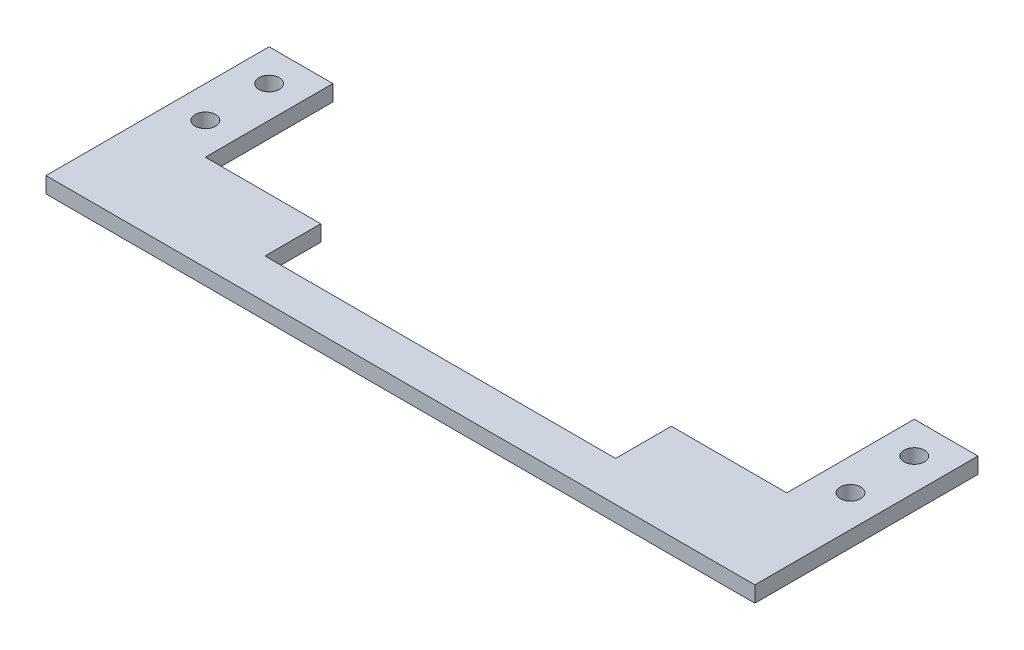
ISO-10303-21;
HEADER;
FILE_DESCRIPTION(('STEP AP214'),'2;1');
FILE_NAME('part.step','',(''),(''),'','','');
FILE_SCHEMA(('AUTOMOTIVE_DESIGN { 1 0 10303 214 1 1 1 1 }'));
ENDSEC;
DATA;
#1=APPLICATION_CONTEXT('core data for automotive mechanical design processes');
#2=APPLICATION_PROTOCOL_DEFINITION('international standard','automotive_design',2000,#1);
#3=PRODUCT_CONTEXT('',#1,'mechanical');
#4=PRODUCT('Part','Part','',(#3));
#5=PRODUCT_RELATED_PRODUCT_CATEGORY('part','',(#4));
#6=PRODUCT_DEFINITION_FORMATION('','',#4);
#7=PRODUCT_DEFINITION_CONTEXT('part definition',#1,'design');
#8=PRODUCT_DEFINITION('design','',#6,#7);
#9=PRODUCT_DEFINITION_SHAPE('','',#8);
#10=(LENGTH_UNIT() NAMED_UNIT(*) SI_UNIT(.MILLI.,.METRE.));
#11=(NAMED_UNIT(*) PLANE_ANGLE_UNIT() SI_UNIT($,.RADIAN.));
#12=(NAMED_UNIT(*) SI_UNIT($,.STERADIAN.) SOLID_ANGLE_UNIT());
#13=UNCERTAINTY_MEASURE_WITH_UNIT(LENGTH_MEASURE(1.E-05),#10,'distance_accuracy_value','');
#14=(GEOMETRIC_REPRESENTATION_CONTEXT(3) GLOBAL_UNCERTAINTY_ASSIGNED_CONTEXT((#13)) GLOBAL_UNIT_ASSIGNED_CONTEXT((#10,
#11,#12)) REPRESENTATION_CONTEXT('',''));
#15=CARTESIAN_POINT('',(0.,0.,0.));
#16=DIRECTION('',(0.,0.,1.));
#17=DIRECTION('',(1.,0.,0.));
#18=AXIS2_PLACEMENT_3D('',#15,#16,#17);
#19=CARTESIAN_POINT('',(0.,3.175,-19.0500000000001));
#20=DIRECTION('',(0.,0.,-1.));
#21=DIRECTION('',(-1.,0.,0.));
#22=AXIS2_PLACEMENT_3D('',#19,#20,#21);
#23=PLANE('',#22);
#24=DIRECTION('',(1.,0.,0.));
#25=VECTOR('',#24,1.);
#26=CARTESIAN_POINT('',(0.,0.,-19.0500000000001));
#27=LINE('',#26,#25);
#28=CARTESIAN_POINT('',(105.537,0.,-19.05));
#29=VERTEX_POINT('',#28);
#30=CARTESIAN_POINT('',(128.524,0.,-19.05));
#31=VERTEX_POINT('',#30);
#32=EDGE_CURVE('E181',#29,#31,#27,.T.);
#33=ORIENTED_EDGE('',*,*,#32,.F.);
#34=DIRECTION('',(0.,-1.,0.));
#35=VECTOR('',#34,1.);
#36=CARTESIAN_POINT('',(105.537,3.175,-19.05));
#37=LINE('',#36,#35);
#38=CARTESIAN_POINT('',(105.537,3.175,-19.05));
#39=VERTEX_POINT('',#38);
#40=EDGE_CURVE('E11',#39,#29,#37,.T.);
#41=ORIENTED_EDGE('',*,*,#40,.F.);
#42=DIRECTION('',(1.,0.,0.));
#43=VECTOR('',#42,1.);
#44=CARTESIAN_POINT('',(0.,3.175,-19.0500000000001));
#45=LINE('',#44,#43);
#46=CARTESIAN_POINT('',(128.524,3.175,-19.05));
#47=VERTEX_POINT('',#46);
#48=EDGE_CURVE('E433',#39,#47,#45,.T.);
#49=ORIENTED_EDGE('',*,*,#48,.T.);
#50=DIRECTION('',(0.,-1.,0.));
#51=VECTOR('',#50,1.);
#52=CARTESIAN_POINT('',(128.524,3.175,-19.05));
#53=LINE('',#52,#51);
#54=EDGE_CURVE('E50',#47,#31,#53,.T.);
#55=ORIENTED_EDGE('',*,*,#54,.T.);
#56=EDGE_LOOP('',(#33,#41,#49,#55));
#57=FACE_BOUND('',#56,.T.);
#58=ADVANCED_FACE('F33',(#57),#23,.T.);
#59=CARTESIAN_POINT('',(105.537,3.175,0.));
#60=DIRECTION('',(1.,0.,0.));
#61=DIRECTION('',(0.,0.,-1.));
#62=AXIS2_PLACEMENT_3D('',#59,#60,#61);
#63=PLANE('',#62);
#64=DIRECTION('',(0.,0.,1.));
#65=VECTOR('',#64,1.);
#66=CARTESIAN_POINT('',(105.537,0.,0.));
#67=LINE('',#66,#65);
#68=CARTESIAN_POINT('',(105.537,0.,-7.93750000000001));
#69=VERTEX_POINT('',#68);
#70=EDGE_CURVE('E178',#29,#69,#67,.T.);
#71=ORIENTED_EDGE('',*,*,#70,.T.);
#72=DIRECTION('',(0.,-1.,0.));
#73=VECTOR('',#72,1.);
#74=CARTESIAN_POINT('',(105.537,3.175,-7.93750000000001));
#75=LINE('',#74,#73);
#76=CARTESIAN_POINT('',(105.537,3.175,-7.93750000000001));
#77=VERTEX_POINT('',#76);
#78=EDGE_CURVE('E42',#77,#69,#75,.T.);
#79=ORIENTED_EDGE('',*,*,#78,.F.);
#80=DIRECTION('',(0.,0.,1.));
#81=VECTOR('',#80,1.);
#82=CARTESIAN_POINT('',(105.537,3.175,0.));
#83=LINE('',#82,#81);
#84=EDGE_CURVE('E431',#39,#77,#83,.T.);
#85=ORIENTED_EDGE('',*,*,#84,.F.);
#86=ORIENTED_EDGE('',*,*,#40,.T.);
#87=EDGE_LOOP('',(#71,#79,#85,#86));
#88=FACE_BOUND('',#87,.T.);
#89=ADVANCED_FACE('F179',(#88),#63,.F.);
#90=CARTESIAN_POINT('',(0.,3.175,-7.93749999999999));
#91=DIRECTION('',(0.,0.,-1.));
#92=DIRECTION('',(-1.,0.,0.));
#93=AXIS2_PLACEMENT_3D('',#90,#91,#92);
#94=PLANE('',#93);
#95=DIRECTION('',(1.,0.,0.));
#96=VECTOR('',#95,1.);
#97=CARTESIAN_POINT('',(0.,0.,-7.93749999999999));
#98=LINE('',#97,#96);
#99=CARTESIAN_POINT('',(35.687,0.,-7.9375));
#100=VERTEX_POINT('',#99);
#101=EDGE_CURVE('E172',#100,#69,#98,.T.);
#102=ORIENTED_EDGE('',*,*,#101,.F.);
#103=DIRECTION('',(0.,-1.,0.));
#104=VECTOR('',#103,1.);
#105=CARTESIAN_POINT('',(35.687,3.175,-7.9375));
#106=LINE('',#105,#104);
#107=CARTESIAN_POINT('',(35.687,3.175,-7.9375));
#108=VERTEX_POINT('',#107);
#109=EDGE_CURVE('E164',#108,#100,#106,.T.);
#110=ORIENTED_EDGE('',*,*,#109,.F.);
#111=DIRECTION('',(1.,0.,0.));
#112=VECTOR('',#111,1.);
#113=CARTESIAN_POINT('',(0.,3.175,-7.93749999999999));
#114=LINE('',#113,#112);
#115=EDGE_CURVE('E175',#108,#77,#114,.T.);
#116=ORIENTED_EDGE('',*,*,#115,.T.);
#117=ORIENTED_EDGE('',*,*,#78,.T.);
#118=EDGE_LOOP('',(#102,#110,#116,#117));
#119=FACE_BOUND('',#118,.T.);
#120=ADVANCED_FACE('F170',(#119),#94,.T.);
#121=CARTESIAN_POINT('',(35.687,3.175,0.));
#122=DIRECTION('',(1.,0.,0.));
#123=DIRECTION('',(0.,0.,-1.));
#124=AXIS2_PLACEMENT_3D('',#121,#122,#123);
#125=PLANE('',#124);
#126=DIRECTION('',(0.,0.,1.));
#127=VECTOR('',#126,1.);
#128=CARTESIAN_POINT('',(35.687,0.,0.));
#129=LINE('',#128,#127);
#130=CARTESIAN_POINT('',(35.687,0.,-19.05));
#131=VERTEX_POINT('',#130);
#132=EDGE_CURVE('E187',#131,#100,#129,.T.);
#133=ORIENTED_EDGE('',*,*,#132,.F.);
#134=DIRECTION('',(0.,-1.,0.));
#135=VECTOR('',#134,1.);
#136=CARTESIAN_POINT('',(35.687,3.175,-19.05));
#137=LINE('',#136,#135);
#138=CARTESIAN_POINT('',(35.687,3.175,-19.05));
#139=VERTEX_POINT('',#138);
#140=EDGE_CURVE('E162',#139,#131,#137,.T.);
#141=ORIENTED_EDGE('',*,*,#140,.F.);
#142=DIRECTION('',(0.,0.,1.));
#143=VECTOR('',#142,1.);
#144=CARTESIAN_POINT('',(35.687,3.175,0.));
#145=LINE('',#144,#143);
#146=EDGE_CURVE('E414',#139,#108,#145,.T.);
#147=ORIENTED_EDGE('',*,*,#146,.T.);
#148=ORIENTED_EDGE('',*,*,#109,.T.);
#149=EDGE_LOOP('',(#133,#141,#147,#148));
#150=FACE_BOUND('',#149,.T.);
#151=ADVANCED_FACE('F373',(#150),#125,.T.);
#152=CARTESIAN_POINT('',(0.,3.175,-19.05));
#153=DIRECTION('',(0.,0.,-1.));
#154=DIRECTION('',(-1.,0.,0.));
#155=AXIS2_PLACEMENT_3D('',#152,#153,#154);
#156=PLANE('',#155);
#157=DIRECTION('',(1.,0.,0.));
#158=VECTOR('',#157,1.);
#159=CARTESIAN_POINT('',(0.,0.,-19.05));
#160=LINE('',#159,#158);
#161=CARTESIAN_POINT('',(12.7,0.,-19.05));
#162=VERTEX_POINT('',#161);
#163=EDGE_CURVE('E189',#162,#131,#160,.T.);
#164=ORIENTED_EDGE('',*,*,#163,.F.);
#165=DIRECTION('',(0.,-1.,0.));
#166=VECTOR('',#165,1.);
#167=CARTESIAN_POINT('',(12.7,3.175,-19.05));
#168=LINE('',#167,#166);
#169=CARTESIAN_POINT('',(12.7,3.175,-19.05));
#170=VERTEX_POINT('',#169);
#171=EDGE_CURVE('E160',#170,#162,#168,.T.);
#172=ORIENTED_EDGE('',*,*,#171,.F.);
#173=DIRECTION('',(1.,0.,0.));
#174=VECTOR('',#173,1.);
#175=CARTESIAN_POINT('',(0.,3.175,-19.05));
#176=LINE('',#175,#174);
#177=EDGE_CURVE('E410',#170,#139,#176,.T.);
#178=ORIENTED_EDGE('',*,*,#177,.T.);
#179=ORIENTED_EDGE('',*,*,#140,.T.);
#180=EDGE_LOOP('',(#164,#172,#178,#179));
#181=FACE_BOUND('',#180,.T.);
#182=ADVANCED_FACE('F363',(#181),#156,.T.);
#183=CARTESIAN_POINT('',(12.7,3.175,0.));
#184=DIRECTION('',(1.,0.,0.));
#185=DIRECTION('',(0.,0.,-1.));
#186=AXIS2_PLACEMENT_3D('',#183,#184,#185);
#187=PLANE('',#186);
#188=DIRECTION('',(0.,0.,1.));
#189=VECTOR('',#188,1.);
#190=CARTESIAN_POINT('',(12.7,0.,0.));
#191=LINE('',#190,#189);
#192=CARTESIAN_POINT('',(12.7,0.,-44.45));
#193=VERTEX_POINT('',#192);
#194=EDGE_CURVE('E194',#193,#162,#191,.T.);
#195=ORIENTED_EDGE('',*,*,#194,.F.);
#196=DIRECTION('',(0.,-1.,0.));
#197=VECTOR('',#196,1.);
#198=CARTESIAN_POINT('',(12.7,3.175,-44.45));
#199=LINE('',#198,#197);
#200=CARTESIAN_POINT('',(12.7,3.175,-44.45));
#201=VERTEX_POINT('',#200);
#202=EDGE_CURVE('E158',#201,#193,#199,.T.);
#203=ORIENTED_EDGE('',*,*,#202,.F.);
#204=DIRECTION('',(0.,0.,1.));
#205=VECTOR('',#204,1.);
#206=CARTESIAN_POINT('',(12.7,3.175,0.));
#207=LINE('',#206,#205);
#208=EDGE_CURVE('E413',#201,#170,#207,.T.);
#209=ORIENTED_EDGE('',*,*,#208,.T.);
#210=ORIENTED_EDGE('',*,*,#171,.T.);
#211=EDGE_LOOP('',(#195,#203,#209,#210));
#212=FACE_BOUND('',#211,.T.);
#213=ADVANCED_FACE('F353',(#212),#187,.T.);
#214=CARTESIAN_POINT('',(0.,3.175,-44.45));
#215=DIRECTION('',(0.,0.,-1.));
#216=DIRECTION('',(-1.,0.,0.));
#217=AXIS2_PLACEMENT_3D('',#214,#215,#216);
#218=PLANE('',#217);
#219=DIRECTION('',(1.,0.,0.));
#220=VECTOR('',#219,1.);
#221=CARTESIAN_POINT('',(0.,0.,-44.45));
#222=LINE('',#221,#220);
#223=CARTESIAN_POINT('',(0.,0.,-44.45));
#224=VERTEX_POINT('',#223);
#225=EDGE_CURVE('E197',#224,#193,#222,.T.);
#226=ORIENTED_EDGE('',*,*,#225,.F.);
#227=DIRECTION('',(0.,-1.,0.));
#228=VECTOR('',#227,1.);
#229=CARTESIAN_POINT('',(0.,3.175,-44.45));
#230=LINE('',#229,#228);
#231=CARTESIAN_POINT('',(0.,3.175,-44.45));
#232=VERTEX_POINT('',#231);
#233=EDGE_CURVE('E156',#232,#224,#230,.T.);
#234=ORIENTED_EDGE('',*,*,#233,.F.);
#235=DIRECTION('',(1.,0.,0.));
#236=VECTOR('',#235,1.);
#237=CARTESIAN_POINT('',(0.,3.175,-44.45));
#238=LINE('',#237,#236);
#239=EDGE_CURVE('E416',#232,#201,#238,.T.);
#240=ORIENTED_EDGE('',*,*,#239,.T.);
#241=ORIENTED_EDGE('',*,*,#202,.T.);
#242=EDGE_LOOP('',(#226,#234,#240,#241));
#243=FACE_BOUND('',#242,.T.);
#244=ADVANCED_FACE('F341',(#243),#218,.T.);
#245=CARTESIAN_POINT('',(0.,3.175,0.));
#246=DIRECTION('',(-1.,0.,0.));
#247=DIRECTION('',(0.,0.,1.));
#248=AXIS2_PLACEMENT_3D('',#245,#246,#247);
#249=PLANE('',#248);
#250=DIRECTION('',(0.,0.,-1.));
#251=VECTOR('',#250,1.);
#252=CARTESIAN_POINT('',(0.,0.,0.));
#253=LINE('',#252,#251);
#254=CARTESIAN_POINT('',(0.,0.,0.));
#255=VERTEX_POINT('',#254);
#256=EDGE_CURVE('E200',#255,#224,#253,.T.);
#257=ORIENTED_EDGE('',*,*,#256,.F.);
#258=DIRECTION('',(0.,-1.,0.));
#259=VECTOR('',#258,1.);
#260=CARTESIAN_POINT('',(0.,3.175,0.));
#261=LINE('',#260,#259);
#262=CARTESIAN_POINT('',(0.,3.175,0.));
#263=VERTEX_POINT('',#262);
#264=EDGE_CURVE('E150',#263,#255,#261,.T.);
#265=ORIENTED_EDGE('',*,*,#264,.F.);
#266=DIRECTION('',(0.,0.,-1.));
#267=VECTOR('',#266,1.);
#268=CARTESIAN_POINT('',(0.,3.175,0.));
#269=LINE('',#268,#267);
#270=EDGE_CURVE('E423',#263,#232,#269,.T.);
#271=ORIENTED_EDGE('',*,*,#270,.T.);
#272=ORIENTED_EDGE('',*,*,#233,.T.);
#273=EDGE_LOOP('',(#257,#265,#271,#272));
#274=FACE_BOUND('',#273,.T.);
#275=ADVANCED_FACE('F332',(#274),#249,.T.);
#276=CARTESIAN_POINT('',(0.,3.175,0.));
#277=DIRECTION('',(0.,0.,-1.));
#278=DIRECTION('',(-1.,0.,0.));
#279=AXIS2_PLACEMENT_3D('',#276,#277,#278);
#280=PLANE('',#279);
#281=DIRECTION('',(1.,0.,0.));
#282=VECTOR('',#281,1.);
#283=CARTESIAN_POINT('',(0.,0.,0.));
#284=LINE('',#283,#282);
#285=CARTESIAN_POINT('',(141.224,0.,0.));
#286=VERTEX_POINT('',#285);
#287=EDGE_CURVE('E203',#255,#286,#284,.T.);
#288=ORIENTED_EDGE('',*,*,#287,.T.);
#289=DIRECTION('',(0.,-1.,0.));
#290=VECTOR('',#289,1.);
#291=CARTESIAN_POINT('',(141.224,3.175,0.));
#292=LINE('',#291,#290);
#293=CARTESIAN_POINT('',(141.224,3.175,0.));
#294=VERTEX_POINT('',#293);
#295=EDGE_CURVE('E148',#294,#286,#292,.T.);
#296=ORIENTED_EDGE('',*,*,#295,.F.);
#297=DIRECTION('',(1.,0.,0.));
#298=VECTOR('',#297,1.);
#299=CARTESIAN_POINT('',(0.,3.175,0.));
#300=LINE('',#299,#298);
#301=EDGE_CURVE('E141',#263,#294,#300,.T.);
#302=ORIENTED_EDGE('',*,*,#301,.F.);
#303=ORIENTED_EDGE('',*,*,#264,.T.);
#304=EDGE_LOOP('',(#288,#296,#302,#303));
#305=FACE_BOUND('',#304,.T.);
#306=ADVANCED_FACE('F324',(#305),#280,.F.);
#307=CARTESIAN_POINT('',(141.224,3.175,0.));
#308=DIRECTION('',(-1.,0.,0.));
#309=DIRECTION('',(0.,0.,1.));
#310=AXIS2_PLACEMENT_3D('',#307,#308,#309);
#311=PLANE('',#310);
#312=DIRECTION('',(0.,0.,-1.));
#313=VECTOR('',#312,1.);
#314=CARTESIAN_POINT('',(141.224,0.,0.));
#315=LINE('',#314,#313);
#316=CARTESIAN_POINT('',(141.224,0.,-44.45));
#317=VERTEX_POINT('',#316);
#318=EDGE_CURVE('E147',#286,#317,#315,.T.);
#319=ORIENTED_EDGE('',*,*,#318,.T.);
#320=DIRECTION('',(0.,-1.,0.));
#321=VECTOR('',#320,1.);
#322=CARTESIAN_POINT('',(141.224,3.175,-44.45));
#323=LINE('',#322,#321);
#324=CARTESIAN_POINT('',(141.224,3.175,-44.45));
#325=VERTEX_POINT('',#324);
#326=EDGE_CURVE('E128',#325,#317,#323,.T.);
#327=ORIENTED_EDGE('',*,*,#326,.F.);
#328=DIRECTION('',(0.,0.,-1.));
#329=VECTOR('',#328,1.);
#330=CARTESIAN_POINT('',(141.224,3.175,0.));
#331=LINE('',#330,#329);
#332=EDGE_CURVE('E133',#294,#325,#331,.T.);
#333=ORIENTED_EDGE('',*,*,#332,.F.);
#334=ORIENTED_EDGE('',*,*,#295,.T.);
#335=EDGE_LOOP('',(#319,#327,#333,#334));
#336=FACE_BOUND('',#335,.T.);
#337=ADVANCED_FACE('F146',(#336),#311,.F.);
#338=CARTESIAN_POINT('',(0.,3.175,-44.45));
#339=DIRECTION('',(0.,0.,1.));
#340=DIRECTION('',(1.,0.,0.));
#341=AXIS2_PLACEMENT_3D('',#338,#339,#340);
#342=PLANE('',#341);
#343=DIRECTION('',(-1.,0.,0.));
#344=VECTOR('',#343,1.);
#345=CARTESIAN_POINT('',(0.,0.,-44.45));
#346=LINE('',#345,#344);
#347=CARTESIAN_POINT('',(128.524,0.,-44.45));
#348=VERTEX_POINT('',#347);
#349=EDGE_CURVE('E207',#317,#348,#346,.T.);
#350=ORIENTED_EDGE('',*,*,#349,.T.);
#351=DIRECTION('',(0.,-1.,0.));
#352=VECTOR('',#351,1.);
#353=CARTESIAN_POINT('',(128.524,3.175,-44.45));
#354=LINE('',#353,#352);
#355=CARTESIAN_POINT('',(128.524,3.175,-44.45));
#356=VERTEX_POINT('',#355);
#357=EDGE_CURVE('E88',#356,#348,#354,.T.);
#358=ORIENTED_EDGE('',*,*,#357,.F.);
#359=DIRECTION('',(-1.,0.,0.));
#360=VECTOR('',#359,1.);
#361=CARTESIAN_POINT('',(0.,3.175,-44.45));
#362=LINE('',#361,#360);
#363=EDGE_CURVE('E124',#325,#356,#362,.T.);
#364=ORIENTED_EDGE('',*,*,#363,.F.);
#365=ORIENTED_EDGE('',*,*,#326,.T.);
#366=EDGE_LOOP('',(#350,#358,#364,#365));
#367=FACE_BOUND('',#366,.T.);
#368=ADVANCED_FACE('F126',(#367),#342,.F.);
#369=CARTESIAN_POINT('',(128.524,3.175,0.));
#370=DIRECTION('',(-1.,0.,0.));
#371=DIRECTION('',(0.,0.,1.));
#372=AXIS2_PLACEMENT_3D('',#369,#370,#371);
#373=PLANE('',#372);
#374=DIRECTION('',(0.,0.,-1.));
#375=VECTOR('',#374,1.);
#376=CARTESIAN_POINT('',(128.524,0.,0.));
#377=LINE('',#376,#375);
#378=EDGE_CURVE('E209',#31,#348,#377,.T.);
#379=ORIENTED_EDGE('',*,*,#378,.F.);
#380=ORIENTED_EDGE('',*,*,#54,.F.);
#381=DIRECTION('',(0.,0.,-1.));
#382=VECTOR('',#381,1.);
#383=CARTESIAN_POINT('',(128.524,3.175,0.));
#384=LINE('',#383,#382);
#385=EDGE_CURVE('E132',#47,#356,#384,.T.);
#386=ORIENTED_EDGE('',*,*,#385,.T.);
#387=ORIENTED_EDGE('',*,*,#357,.T.);
#388=EDGE_LOOP('',(#379,#380,#386,#387));
#389=FACE_BOUND('',#388,.T.);
#390=ADVANCED_FACE('F229',(#389),#373,.T.);
#391=CARTESIAN_POINT('',(6.35,3.175,-38.1));
#392=DIRECTION('',(0.,-1.,0.));
#393=DIRECTION('',(0.,0.,-1.));
#394=AXIS2_PLACEMENT_3D('',#391,#392,#393);
#395=CYLINDRICAL_SURFACE('',#394,2.032);
#396=CARTESIAN_POINT('',(6.35,3.175,-38.1));
#397=DIRECTION('',(0.,1.,0.));
#398=DIRECTION('',(0.,0.,1.));
#399=AXIS2_PLACEMENT_3D('',#396,#397,#398);
#400=CIRCLE('',#399,2.032);
#401=CARTESIAN_POINT('',(6.35,3.175,-36.068));
#402=VERTEX_POINT('',#401);
#403=EDGE_CURVE('E435',#402,#402,#400,.T.);
#404=ORIENTED_EDGE('',*,*,#403,.T.);
#405=EDGE_LOOP('',(#404));
#406=FACE_BOUND('',#405,.T.);
#407=CARTESIAN_POINT('',(6.35,0.,-38.1));
#408=DIRECTION('',(0.,1.,0.));
#409=DIRECTION('',(0.,0.,1.));
#410=AXIS2_PLACEMENT_3D('',#407,#408,#409);
#411=CIRCLE('',#410,2.032);
#412=CARTESIAN_POINT('',(6.35,0.,-36.068));
#413=VERTEX_POINT('',#412);
#414=EDGE_CURVE('E227',#413,#413,#411,.T.);
#415=ORIENTED_EDGE('',*,*,#414,.F.);
#416=EDGE_LOOP('',(#415));
#417=FACE_BOUND('',#416,.T.);
#418=ADVANCED_FACE('F231',(#406,#417),#395,.F.);
#419=CARTESIAN_POINT('',(6.35,3.175,-25.4));
#420=DIRECTION('',(0.,-1.,0.));
#421=DIRECTION('',(0.,0.,-1.));
#422=AXIS2_PLACEMENT_3D('',#419,#420,#421);
#423=CYLINDRICAL_SURFACE('',#422,2.032);
#424=CARTESIAN_POINT('',(6.35,3.175,-25.4));
#425=DIRECTION('',(0.,1.,0.));
#426=DIRECTION('',(0.,0.,1.));
#427=AXIS2_PLACEMENT_3D('',#424,#425,#426);
#428=CIRCLE('',#427,2.032);
#429=CARTESIAN_POINT('',(6.35,3.175,-23.368));
#430=VERTEX_POINT('',#429);
#431=EDGE_CURVE('E259',#430,#430,#428,.T.);
#432=ORIENTED_EDGE('',*,*,#431,.T.);
#433=EDGE_LOOP('',(#432));
#434=FACE_BOUND('',#433,.T.);
#435=CARTESIAN_POINT('',(6.35,0.,-25.4));
#436=DIRECTION('',(0.,1.,0.));
#437=DIRECTION('',(0.,0.,1.));
#438=AXIS2_PLACEMENT_3D('',#435,#436,#437);
#439=CIRCLE('',#438,2.032);
#440=CARTESIAN_POINT('',(6.35,0.,-23.368));
#441=VERTEX_POINT('',#440);
#442=EDGE_CURVE('E224',#441,#441,#439,.T.);
#443=ORIENTED_EDGE('',*,*,#442,.F.);
#444=EDGE_LOOP('',(#443));
#445=FACE_BOUND('',#444,.T.);
#446=ADVANCED_FACE('F237',(#434,#445),#423,.F.);
#447=CARTESIAN_POINT('',(134.874,3.175,-38.0999999999997));
#448=DIRECTION('',(0.,-1.,0.));
#449=DIRECTION('',(0.,0.,-1.));
#450=AXIS2_PLACEMENT_3D('',#447,#448,#449);
#451=CYLINDRICAL_SURFACE('',#450,2.03200000000001);
#452=CARTESIAN_POINT('',(134.874,3.175,-38.0999999999997));
#453=DIRECTION('',(0.,1.,0.));
#454=DIRECTION('',(0.,0.,1.));
#455=AXIS2_PLACEMENT_3D('',#452,#453,#454);
#456=CIRCLE('',#455,2.03200000000001);
#457=CARTESIAN_POINT('',(134.874,3.175,-36.0679999999997));
#458=VERTEX_POINT('',#457);
#459=EDGE_CURVE('E214',#458,#458,#456,.F.);
#460=ORIENTED_EDGE('',*,*,#459,.F.);
#461=EDGE_LOOP('',(#460));
#462=FACE_BOUND('',#461,.T.);
#463=CARTESIAN_POINT('',(134.874,0.,-38.0999999999997));
#464=DIRECTION('',(0.,1.,0.));
#465=DIRECTION('',(0.,0.,1.));
#466=AXIS2_PLACEMENT_3D('',#463,#464,#465);
#467=CIRCLE('',#466,2.03200000000001);
#468=CARTESIAN_POINT('',(134.874,0.,-36.0679999999997));
#469=VERTEX_POINT('',#468);
#470=EDGE_CURVE('E221',#469,#469,#467,.F.);
#471=ORIENTED_EDGE('',*,*,#470,.T.);
#472=EDGE_LOOP('',(#471));
#473=FACE_BOUND('',#472,.T.);
#474=ADVANCED_FACE('F35',(#462,#473),#451,.F.);
#475=CARTESIAN_POINT('',(134.874,3.175,-25.3999999999997));
#476=DIRECTION('',(0.,-1.,0.));
#477=DIRECTION('',(0.,0.,-1.));
#478=AXIS2_PLACEMENT_3D('',#475,#476,#477);
#479=CYLINDRICAL_SURFACE('',#478,2.03199999999998);
#480=CARTESIAN_POINT('',(134.874,3.175,-25.3999999999997));
#481=DIRECTION('',(0.,1.,0.));
#482=DIRECTION('',(0.,0.,1.));
#483=AXIS2_PLACEMENT_3D('',#480,#481,#482);
#484=CIRCLE('',#483,2.03199999999998);
#485=CARTESIAN_POINT('',(134.874,3.175,-23.3679999999997));
#486=VERTEX_POINT('',#485);
#487=EDGE_CURVE('E215',#486,#486,#484,.F.);
#488=ORIENTED_EDGE('',*,*,#487,.F.);
#489=EDGE_LOOP('',(#488));
#490=FACE_BOUND('',#489,.T.);
#491=CARTESIAN_POINT('',(134.874,0.,-25.3999999999997));
#492=DIRECTION('',(0.,1.,0.));
#493=DIRECTION('',(0.,0.,1.));
#494=AXIS2_PLACEMENT_3D('',#491,#492,#493);
#495=CIRCLE('',#494,2.03199999999998);
#496=CARTESIAN_POINT('',(134.874,0.,-23.3679999999997));
#497=VERTEX_POINT('',#496);
#498=EDGE_CURVE('E212',#497,#497,#495,.F.);
#499=ORIENTED_EDGE('',*,*,#498,.T.);
#500=EDGE_LOOP('',(#499));
#501=FACE_BOUND('',#500,.T.);
#502=ADVANCED_FACE('F254',(#490,#501),#479,.F.);
#503=CARTESIAN_POINT('',(0.,3.175,0.));
#504=DIRECTION('',(0.,1.,0.));
#505=DIRECTION('',(0.,0.,1.));
#506=AXIS2_PLACEMENT_3D('',#503,#504,#505);
#507=PLANE('',#506);
#508=ORIENTED_EDGE('',*,*,#459,.T.);
#509=EDGE_LOOP('',(#508));
#510=FACE_BOUND('',#509,.T.);
#511=ORIENTED_EDGE('',*,*,#431,.F.);
#512=EDGE_LOOP('',(#511));
#513=FACE_BOUND('',#512,.T.);
#514=ORIENTED_EDGE('',*,*,#403,.F.);
#515=EDGE_LOOP('',(#514));
#516=FACE_BOUND('',#515,.T.);
#517=ORIENTED_EDGE('',*,*,#48,.F.);
#518=ORIENTED_EDGE('',*,*,#84,.T.);
#519=ORIENTED_EDGE('',*,*,#115,.F.);
#520=ORIENTED_EDGE('',*,*,#146,.F.);
#521=ORIENTED_EDGE('',*,*,#177,.F.);
#522=ORIENTED_EDGE('',*,*,#208,.F.);
#523=ORIENTED_EDGE('',*,*,#239,.F.);
#524=ORIENTED_EDGE('',*,*,#270,.F.);
#525=ORIENTED_EDGE('',*,*,#301,.T.);
#526=ORIENTED_EDGE('',*,*,#332,.T.);
#527=ORIENTED_EDGE('',*,*,#363,.T.);
#528=ORIENTED_EDGE('',*,*,#385,.F.);
#529=EDGE_LOOP('',(#517,#518,#519,#520,#521,#522,#523,#524,#525,#526,#527,#528));
#530=FACE_BOUND('',#529,.T.);
#531=ORIENTED_EDGE('',*,*,#487,.T.);
#532=EDGE_LOOP('',(#531));
#533=FACE_BOUND('',#532,.T.);
#534=ADVANCED_FACE('F137',(#510,#513,#516,#530,#533),#507,.T.);
#535=CARTESIAN_POINT('',(0.,0.,0.));
#536=DIRECTION('',(0.,1.,0.));
#537=DIRECTION('',(0.,0.,1.));
#538=AXIS2_PLACEMENT_3D('',#535,#536,#537);
#539=PLANE('',#538);
#540=ORIENTED_EDGE('',*,*,#470,.F.);
#541=EDGE_LOOP('',(#540));
#542=FACE_BOUND('',#541,.T.);
#543=ORIENTED_EDGE('',*,*,#442,.T.);
#544=EDGE_LOOP('',(#543));
#545=FACE_BOUND('',#544,.T.);
#546=ORIENTED_EDGE('',*,*,#414,.T.);
#547=EDGE_LOOP('',(#546));
#548=FACE_BOUND('',#547,.T.);
#549=ORIENTED_EDGE('',*,*,#32,.T.);
#550=ORIENTED_EDGE('',*,*,#378,.T.);
#551=ORIENTED_EDGE('',*,*,#349,.F.);
#552=ORIENTED_EDGE('',*,*,#318,.F.);
#553=ORIENTED_EDGE('',*,*,#287,.F.);
#554=ORIENTED_EDGE('',*,*,#256,.T.);
#555=ORIENTED_EDGE('',*,*,#225,.T.);
#556=ORIENTED_EDGE('',*,*,#194,.T.);
#557=ORIENTED_EDGE('',*,*,#163,.T.);
#558=ORIENTED_EDGE('',*,*,#132,.T.);
#559=ORIENTED_EDGE('',*,*,#101,.T.);
#560=ORIENTED_EDGE('',*,*,#70,.F.);
#561=EDGE_LOOP('',(#549,#550,#551,#552,#553,#554,#555,#556,#557,#558,#559,#560));
#562=FACE_BOUND('',#561,.T.);
#563=ORIENTED_EDGE('',*,*,#498,.F.);
#564=EDGE_LOOP('',(#563));
#565=FACE_BOUND('',#564,.T.);
#566=ADVANCED_FACE('F183',(#542,#545,#548,#562,#565),#539,.F.);
#567=CLOSED_SHELL('',(#58,#89,#120,#151,#182,#213,#244,#275,#306,#337,#368,#390,#418,#446,#474,
#502,#534,#566));
#568=MANIFOLD_SOLID_BREP('B2',#567);
#569=ADVANCED_BREP_SHAPE_REPRESENTATION('',(#18,#568),#14);
#570=SHAPE_DEFINITION_REPRESENTATION(#9,#569);
ENDSEC;
END-ISO-10303-21;
